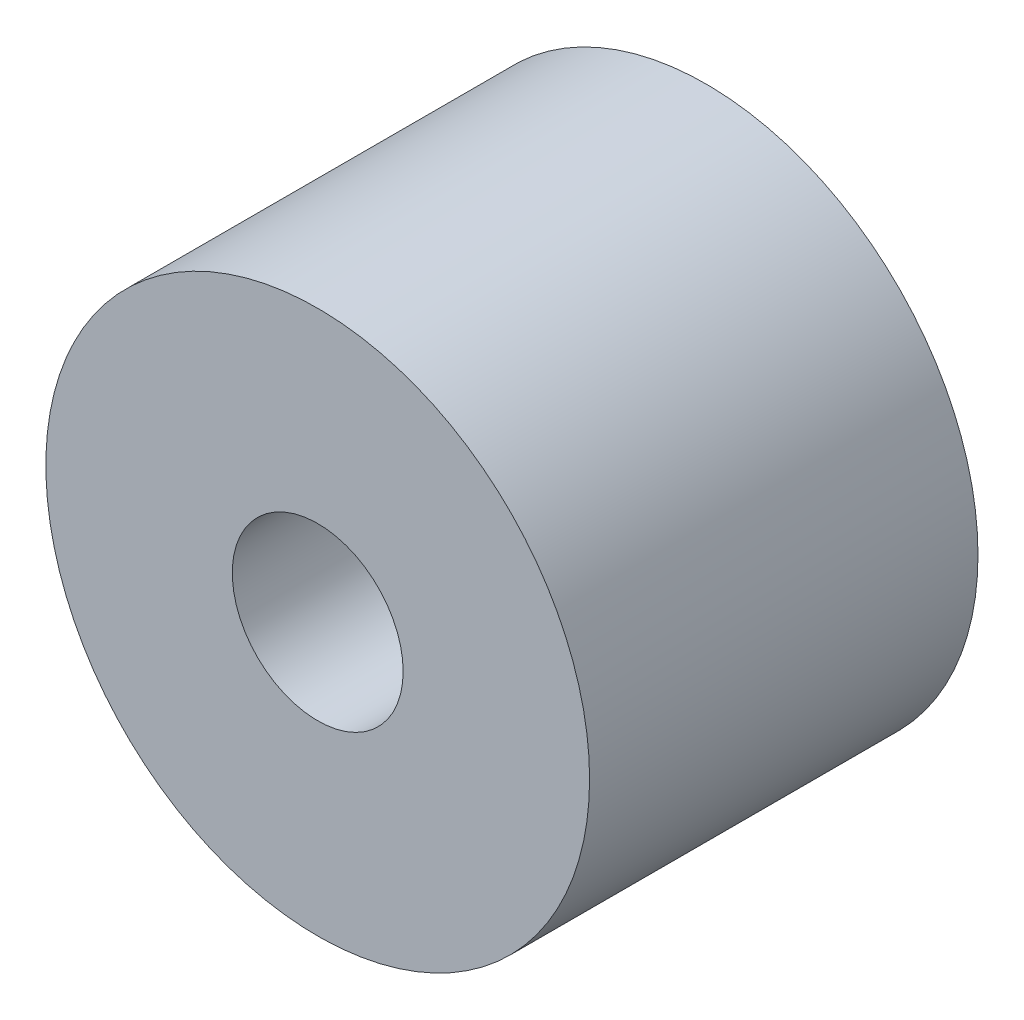
ISO-10303-21;
HEADER;
FILE_DESCRIPTION(('STEP AP214'),'2;1');
FILE_NAME('part.step','',(''),(''),'','','');
FILE_SCHEMA(('AUTOMOTIVE_DESIGN { 1 0 10303 214 1 1 1 1 }'));
ENDSEC;
DATA;
#1=APPLICATION_CONTEXT('core data for automotive mechanical design processes');
#2=APPLICATION_PROTOCOL_DEFINITION('international standard','automotive_design',2000,#1);
#3=PRODUCT_CONTEXT('',#1,'mechanical');
#4=PRODUCT('Part','Part','',(#3));
#5=PRODUCT_RELATED_PRODUCT_CATEGORY('part','',(#4));
#6=PRODUCT_DEFINITION_FORMATION('','',#4);
#7=PRODUCT_DEFINITION_CONTEXT('part definition',#1,'design');
#8=PRODUCT_DEFINITION('design','',#6,#7);
#9=PRODUCT_DEFINITION_SHAPE('','',#8);
#10=(LENGTH_UNIT() NAMED_UNIT(*) SI_UNIT(.MILLI.,.METRE.));
#11=(NAMED_UNIT(*) PLANE_ANGLE_UNIT() SI_UNIT($,.RADIAN.));
#12=(NAMED_UNIT(*) SI_UNIT($,.STERADIAN.) SOLID_ANGLE_UNIT());
#13=UNCERTAINTY_MEASURE_WITH_UNIT(LENGTH_MEASURE(1.E-05),#10,'distance_accuracy_value','');
#14=(GEOMETRIC_REPRESENTATION_CONTEXT(3) GLOBAL_UNCERTAINTY_ASSIGNED_CONTEXT((#13)) GLOBAL_UNIT_ASSIGNED_CONTEXT((#10,
#11,#12)) REPRESENTATION_CONTEXT('',''));
#15=CARTESIAN_POINT('',(0.,0.,0.));
#16=DIRECTION('',(0.,0.,1.));
#17=DIRECTION('',(1.,0.,0.));
#18=AXIS2_PLACEMENT_3D('',#15,#16,#17);
#19=CARTESIAN_POINT('',(0.,0.,5.));
#20=DIRECTION('',(0.,0.,1.));
#21=DIRECTION('',(1.,0.,0.));
#22=AXIS2_PLACEMENT_3D('',#19,#20,#21);
#23=PLANE('',#22);
#24=CARTESIAN_POINT('',(0.,0.,5.));
#25=DIRECTION('',(0.,0.,1.));
#26=DIRECTION('',(1.,0.,0.));
#27=AXIS2_PLACEMENT_3D('',#24,#25,#26);
#28=CIRCLE('',#27,3.5);
#29=CARTESIAN_POINT('',(3.5,0.,5.));
#30=VERTEX_POINT('',#29);
#31=EDGE_CURVE('E10',#30,#30,#28,.T.);
#32=ORIENTED_EDGE('',*,*,#31,.T.);
#33=EDGE_LOOP('',(#32));
#34=FACE_BOUND('',#33,.T.);
#35=CARTESIAN_POINT('',(0.,0.,5.));
#36=DIRECTION('',(0.,0.,1.));
#37=DIRECTION('',(1.,0.,0.));
#38=AXIS2_PLACEMENT_3D('',#35,#36,#37);
#39=CIRCLE('',#38,1.1);
#40=CARTESIAN_POINT('',(1.1,0.,5.));
#41=VERTEX_POINT('',#40);
#42=EDGE_CURVE('E42',#41,#41,#39,.T.);
#43=ORIENTED_EDGE('',*,*,#42,.F.);
#44=EDGE_LOOP('',(#43));
#45=FACE_BOUND('',#44,.T.);
#46=ADVANCED_FACE('F31',(#34,#45),#23,.T.);
#47=CARTESIAN_POINT('',(0.,0.,0.));
#48=DIRECTION('',(0.,0.,1.));
#49=DIRECTION('',(1.,0.,0.));
#50=AXIS2_PLACEMENT_3D('',#47,#48,#49);
#51=PLANE('',#50);
#52=CARTESIAN_POINT('',(0.,0.,0.));
#53=DIRECTION('',(0.,0.,1.));
#54=DIRECTION('',(1.,0.,0.));
#55=AXIS2_PLACEMENT_3D('',#52,#53,#54);
#56=CIRCLE('',#55,3.5);
#57=CARTESIAN_POINT('',(3.5,0.,0.));
#58=VERTEX_POINT('',#57);
#59=EDGE_CURVE('E35',#58,#58,#56,.T.);
#60=ORIENTED_EDGE('',*,*,#59,.F.);
#61=EDGE_LOOP('',(#60));
#62=FACE_BOUND('',#61,.T.);
#63=CARTESIAN_POINT('',(0.,0.,0.));
#64=DIRECTION('',(0.,0.,1.));
#65=DIRECTION('',(1.,0.,0.));
#66=AXIS2_PLACEMENT_3D('',#63,#64,#65);
#67=CIRCLE('',#66,1.1);
#68=CARTESIAN_POINT('',(1.1,0.,0.));
#69=VERTEX_POINT('',#68);
#70=EDGE_CURVE('E44',#69,#69,#67,.T.);
#71=ORIENTED_EDGE('',*,*,#70,.T.);
#72=EDGE_LOOP('',(#71));
#73=FACE_BOUND('',#72,.T.);
#74=ADVANCED_FACE('F54',(#62,#73),#51,.F.);
#75=CARTESIAN_POINT('',(0.,0.,5.));
#76=DIRECTION('',(0.,0.,-1.));
#77=DIRECTION('',(-1.,0.,0.));
#78=AXIS2_PLACEMENT_3D('',#75,#76,#77);
#79=CYLINDRICAL_SURFACE('',#78,3.5);
#80=ORIENTED_EDGE('',*,*,#31,.F.);
#81=EDGE_LOOP('',(#80));
#82=FACE_BOUND('',#81,.T.);
#83=ORIENTED_EDGE('',*,*,#59,.T.);
#84=EDGE_LOOP('',(#83));
#85=FACE_BOUND('',#84,.T.);
#86=ADVANCED_FACE('F33',(#82,#85),#79,.T.);
#87=CARTESIAN_POINT('',(0.,0.,5.));
#88=DIRECTION('',(0.,0.,-1.));
#89=DIRECTION('',(-1.,0.,0.));
#90=AXIS2_PLACEMENT_3D('',#87,#88,#89);
#91=CYLINDRICAL_SURFACE('',#90,1.1);
#92=ORIENTED_EDGE('',*,*,#42,.T.);
#93=EDGE_LOOP('',(#92));
#94=FACE_BOUND('',#93,.T.);
#95=ORIENTED_EDGE('',*,*,#70,.F.);
#96=EDGE_LOOP('',(#95));
#97=FACE_BOUND('',#96,.T.);
#98=ADVANCED_FACE('F50',(#94,#97),#91,.F.);
#99=CLOSED_SHELL('',(#46,#74,#86,#98));
#100=MANIFOLD_SOLID_BREP('B2',#99);
#101=ADVANCED_BREP_SHAPE_REPRESENTATION('',(#18,#100),#14);
#102=SHAPE_DEFINITION_REPRESENTATION(#9,#101);
ENDSEC;
END-ISO-10303-21;
